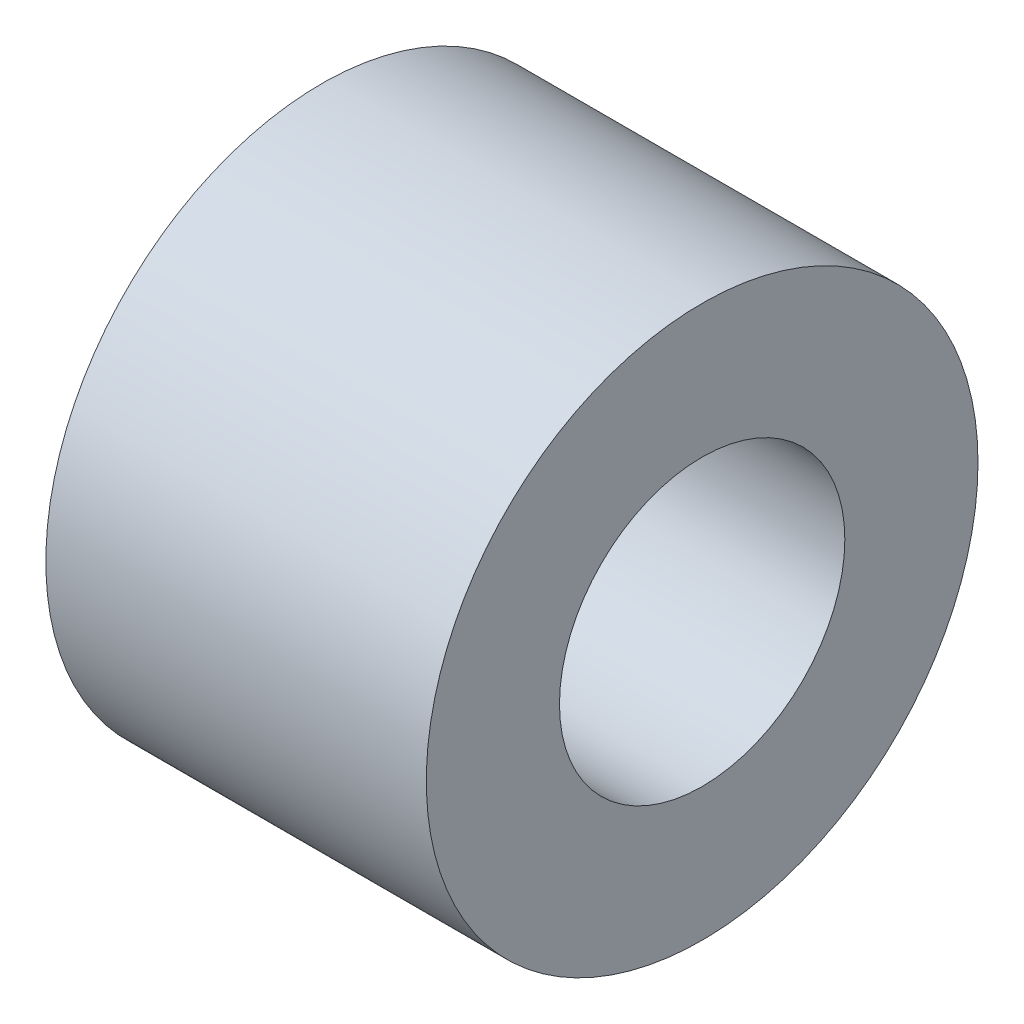
ISO-10303-21;
HEADER;
FILE_DESCRIPTION(('STEP AP214'),'2;1');
FILE_NAME('part.step','',(''),(''),'','','');
FILE_SCHEMA(('AUTOMOTIVE_DESIGN { 1 0 10303 214 1 1 1 1 }'));
ENDSEC;
DATA;
#1=APPLICATION_CONTEXT('core data for automotive mechanical design processes');
#2=APPLICATION_PROTOCOL_DEFINITION('international standard','automotive_design',2000,#1);
#3=PRODUCT_CONTEXT('',#1,'mechanical');
#4=PRODUCT('Part','Part','',(#3));
#5=PRODUCT_RELATED_PRODUCT_CATEGORY('part','',(#4));
#6=PRODUCT_DEFINITION_FORMATION('','',#4);
#7=PRODUCT_DEFINITION_CONTEXT('part definition',#1,'design');
#8=PRODUCT_DEFINITION('design','',#6,#7);
#9=PRODUCT_DEFINITION_SHAPE('','',#8);
#10=(LENGTH_UNIT() NAMED_UNIT(*) SI_UNIT(.MILLI.,.METRE.));
#11=(NAMED_UNIT(*) PLANE_ANGLE_UNIT() SI_UNIT($,.RADIAN.));
#12=(NAMED_UNIT(*) SI_UNIT($,.STERADIAN.) SOLID_ANGLE_UNIT());
#13=UNCERTAINTY_MEASURE_WITH_UNIT(LENGTH_MEASURE(1.E-05),#10,'distance_accuracy_value','');
#14=(GEOMETRIC_REPRESENTATION_CONTEXT(3) GLOBAL_UNCERTAINTY_ASSIGNED_CONTEXT((#13)) GLOBAL_UNIT_ASSIGNED_CONTEXT((#10,
#11,#12)) REPRESENTATION_CONTEXT('',''));
#15=CARTESIAN_POINT('',(0.,0.,0.));
#16=DIRECTION('',(0.,0.,1.));
#17=DIRECTION('',(1.,0.,0.));
#18=AXIS2_PLACEMENT_3D('',#15,#16,#17);
#19=CARTESIAN_POINT('',(4.,0.,0.));
#20=DIRECTION('',(1.,0.,0.));
#21=DIRECTION('',(0.,0.,-1.));
#22=AXIS2_PLACEMENT_3D('',#19,#20,#21);
#23=PLANE('',#22);
#24=CARTESIAN_POINT('',(4.,0.,0.));
#25=DIRECTION('',(1.,0.,0.));
#26=DIRECTION('',(0.,0.,-1.));
#27=AXIS2_PLACEMENT_3D('',#24,#25,#26);
#28=CIRCLE('',#27,2.9);
#29=CARTESIAN_POINT('',(4.,0.,-2.9));
#30=VERTEX_POINT('',#29);
#31=EDGE_CURVE('E10',#30,#30,#28,.T.);
#32=ORIENTED_EDGE('',*,*,#31,.T.);
#33=EDGE_LOOP('',(#32));
#34=FACE_BOUND('',#33,.T.);
#35=CARTESIAN_POINT('',(4.,0.,0.));
#36=DIRECTION('',(1.,0.,0.));
#37=DIRECTION('',(0.,0.,-1.));
#38=AXIS2_PLACEMENT_3D('',#35,#36,#37);
#39=CIRCLE('',#38,1.5);
#40=CARTESIAN_POINT('',(4.,0.,-1.5));
#41=VERTEX_POINT('',#40);
#42=EDGE_CURVE('E37',#41,#41,#39,.T.);
#43=ORIENTED_EDGE('',*,*,#42,.F.);
#44=EDGE_LOOP('',(#43));
#45=FACE_BOUND('',#44,.T.);
#46=ADVANCED_FACE('F26',(#34,#45),#23,.T.);
#47=CARTESIAN_POINT('',(0.,0.,0.));
#48=DIRECTION('',(1.,0.,0.));
#49=DIRECTION('',(0.,0.,-1.));
#50=AXIS2_PLACEMENT_3D('',#47,#48,#49);
#51=PLANE('',#50);
#52=CARTESIAN_POINT('',(0.,0.,0.));
#53=DIRECTION('',(1.,0.,0.));
#54=DIRECTION('',(0.,0.,-1.));
#55=AXIS2_PLACEMENT_3D('',#52,#53,#54);
#56=CIRCLE('',#55,2.9);
#57=CARTESIAN_POINT('',(0.,0.,-2.9));
#58=VERTEX_POINT('',#57);
#59=EDGE_CURVE('E33',#58,#58,#56,.T.);
#60=ORIENTED_EDGE('',*,*,#59,.F.);
#61=EDGE_LOOP('',(#60));
#62=FACE_BOUND('',#61,.T.);
#63=CARTESIAN_POINT('',(0.,0.,0.));
#64=DIRECTION('',(1.,0.,0.));
#65=DIRECTION('',(0.,0.,-1.));
#66=AXIS2_PLACEMENT_3D('',#63,#64,#65);
#67=CIRCLE('',#66,1.5);
#68=CARTESIAN_POINT('',(0.,0.,-1.5));
#69=VERTEX_POINT('',#68);
#70=EDGE_CURVE('E41',#69,#69,#67,.T.);
#71=ORIENTED_EDGE('',*,*,#70,.T.);
#72=EDGE_LOOP('',(#71));
#73=FACE_BOUND('',#72,.T.);
#74=ADVANCED_FACE('F47',(#62,#73),#51,.F.);
#75=CARTESIAN_POINT('',(4.,0.,0.));
#76=DIRECTION('',(-1.,0.,0.));
#77=DIRECTION('',(0.,0.,1.));
#78=AXIS2_PLACEMENT_3D('',#75,#76,#77);
#79=CYLINDRICAL_SURFACE('',#78,2.9);
#80=ORIENTED_EDGE('',*,*,#31,.F.);
#81=EDGE_LOOP('',(#80));
#82=FACE_BOUND('',#81,.T.);
#83=ORIENTED_EDGE('',*,*,#59,.T.);
#84=EDGE_LOOP('',(#83));
#85=FACE_BOUND('',#84,.T.);
#86=ADVANCED_FACE('F28',(#82,#85),#79,.T.);
#87=CARTESIAN_POINT('',(4.,0.,0.));
#88=DIRECTION('',(-1.,0.,0.));
#89=DIRECTION('',(0.,0.,1.));
#90=AXIS2_PLACEMENT_3D('',#87,#88,#89);
#91=CYLINDRICAL_SURFACE('',#90,1.5);
#92=ORIENTED_EDGE('',*,*,#42,.T.);
#93=EDGE_LOOP('',(#92));
#94=FACE_BOUND('',#93,.T.);
#95=ORIENTED_EDGE('',*,*,#70,.F.);
#96=EDGE_LOOP('',(#95));
#97=FACE_BOUND('',#96,.T.);
#98=ADVANCED_FACE('F49',(#94,#97),#91,.F.);
#99=CLOSED_SHELL('',(#46,#74,#86,#98));
#100=MANIFOLD_SOLID_BREP('B2',#99);
#101=ADVANCED_BREP_SHAPE_REPRESENTATION('',(#18,#100),#14);
#102=SHAPE_DEFINITION_REPRESENTATION(#9,#101);
ENDSEC;
END-ISO-10303-21;
